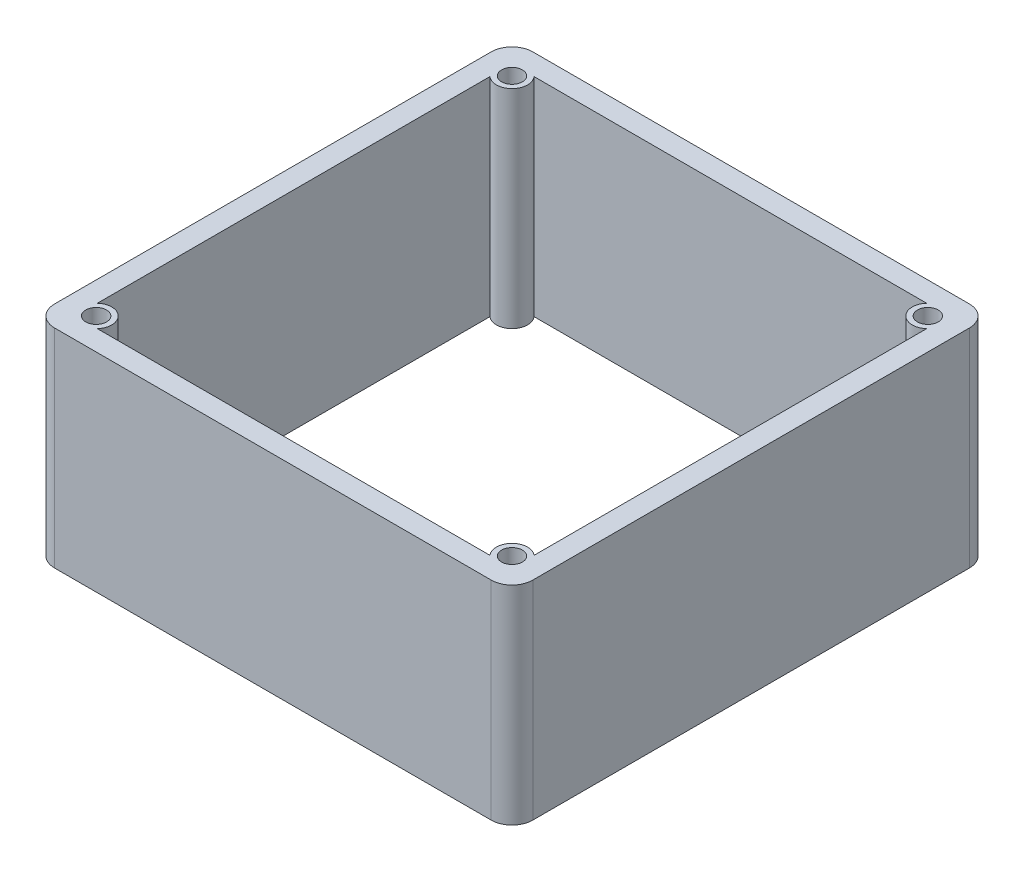
ISO-10303-21;
HEADER;
FILE_DESCRIPTION(('STEP AP214'),'2;1');
FILE_NAME('part.step','',(''),(''),'','','');
FILE_SCHEMA(('AUTOMOTIVE_DESIGN { 1 0 10303 214 1 1 1 1 }'));
ENDSEC;
DATA;
#1=APPLICATION_CONTEXT('core data for automotive mechanical design processes');
#2=APPLICATION_PROTOCOL_DEFINITION('international standard','automotive_design',2000,#1);
#3=PRODUCT_CONTEXT('',#1,'mechanical');
#4=PRODUCT('Part','Part','',(#3));
#5=PRODUCT_RELATED_PRODUCT_CATEGORY('part','',(#4));
#6=PRODUCT_DEFINITION_FORMATION('','',#4);
#7=PRODUCT_DEFINITION_CONTEXT('part definition',#1,'design');
#8=PRODUCT_DEFINITION('design','',#6,#7);
#9=PRODUCT_DEFINITION_SHAPE('','',#8);
#10=(LENGTH_UNIT() NAMED_UNIT(*) SI_UNIT(.MILLI.,.METRE.));
#11=(NAMED_UNIT(*) PLANE_ANGLE_UNIT() SI_UNIT($,.RADIAN.));
#12=(NAMED_UNIT(*) SI_UNIT($,.STERADIAN.) SOLID_ANGLE_UNIT());
#13=UNCERTAINTY_MEASURE_WITH_UNIT(LENGTH_MEASURE(1.E-05),#10,'distance_accuracy_value','');
#14=(GEOMETRIC_REPRESENTATION_CONTEXT(3) GLOBAL_UNCERTAINTY_ASSIGNED_CONTEXT((#13)) GLOBAL_UNIT_ASSIGNED_CONTEXT((#10,
#11,#12)) REPRESENTATION_CONTEXT('',''));
#15=CARTESIAN_POINT('',(0.,0.,0.));
#16=DIRECTION('',(0.,0.,1.));
#17=DIRECTION('',(1.,0.,0.));
#18=AXIS2_PLACEMENT_3D('',#15,#16,#17);
#19=CARTESIAN_POINT('',(0.,20.,0.));
#20=DIRECTION('',(0.,1.,0.));
#21=DIRECTION('',(0.,0.,1.));
#22=AXIS2_PLACEMENT_3D('',#19,#20,#21);
#23=PLANE('',#22);
#24=CARTESIAN_POINT('',(20.,20.,20.));
#25=DIRECTION('',(0.,1.,0.));
#26=DIRECTION('',(0.,0.,1.));
#27=AXIS2_PLACEMENT_3D('',#24,#25,#26);
#28=CIRCLE('',#27,1.);
#29=CARTESIAN_POINT('',(20.,20.,21.));
#30=VERTEX_POINT('',#29);
#31=EDGE_CURVE('E515',#30,#30,#28,.T.);
#32=ORIENTED_EDGE('',*,*,#31,.F.);
#33=EDGE_LOOP('',(#32));
#34=FACE_BOUND('',#33,.T.);
#35=CARTESIAN_POINT('',(-20.,20.,-20.));
#36=DIRECTION('',(0.,1.,0.));
#37=DIRECTION('',(0.,0.,1.));
#38=AXIS2_PLACEMENT_3D('',#35,#36,#37);
#39=CIRCLE('',#38,1.);
#40=CARTESIAN_POINT('',(-20.,20.,-19.));
#41=VERTEX_POINT('',#40);
#42=EDGE_CURVE('E192',#41,#41,#39,.T.);
#43=ORIENTED_EDGE('',*,*,#42,.F.);
#44=EDGE_LOOP('',(#43));
#45=FACE_BOUND('',#44,.T.);
#46=DIRECTION('',(0.,0.,1.));
#47=VECTOR('',#46,1.);
#48=CARTESIAN_POINT('',(-23.,20.,-23.));
#49=LINE('',#48,#47);
#50=CARTESIAN_POINT('',(-23.,20.,-21.));
#51=VERTEX_POINT('',#50);
#52=CARTESIAN_POINT('',(-23.,20.,21.));
#53=VERTEX_POINT('',#52);
#54=EDGE_CURVE('E228',#51,#53,#49,.T.);
#55=ORIENTED_EDGE('',*,*,#54,.T.);
#56=CARTESIAN_POINT('',(-21.,20.,21.));
#57=DIRECTION('',(0.,1.,0.));
#58=DIRECTION('',(0.,0.,1.));
#59=AXIS2_PLACEMENT_3D('',#56,#57,#58);
#60=CIRCLE('',#59,2.);
#61=CARTESIAN_POINT('',(-21.,20.,23.));
#62=VERTEX_POINT('',#61);
#63=EDGE_CURVE('E266',#53,#62,#60,.T.);
#64=ORIENTED_EDGE('',*,*,#63,.T.);
#65=DIRECTION('',(1.,0.,0.));
#66=VECTOR('',#65,1.);
#67=CARTESIAN_POINT('',(-23.,20.,23.));
#68=LINE('',#67,#66);
#69=CARTESIAN_POINT('',(21.,20.,23.));
#70=VERTEX_POINT('',#69);
#71=EDGE_CURVE('E231',#62,#70,#68,.T.);
#72=ORIENTED_EDGE('',*,*,#71,.T.);
#73=CARTESIAN_POINT('',(21.,20.,21.));
#74=DIRECTION('',(0.,1.,0.));
#75=DIRECTION('',(0.,0.,1.));
#76=AXIS2_PLACEMENT_3D('',#73,#74,#75);
#77=CIRCLE('',#76,2.);
#78=CARTESIAN_POINT('',(23.,20.,21.));
#79=VERTEX_POINT('',#78);
#80=EDGE_CURVE('E264',#70,#79,#77,.T.);
#81=ORIENTED_EDGE('',*,*,#80,.T.);
#82=DIRECTION('',(0.,0.,-1.));
#83=VECTOR('',#82,1.);
#84=CARTESIAN_POINT('',(23.,20.,-23.));
#85=LINE('',#84,#83);
#86=CARTESIAN_POINT('',(23.,20.,-21.));
#87=VERTEX_POINT('',#86);
#88=EDGE_CURVE('E223',#79,#87,#85,.T.);
#89=ORIENTED_EDGE('',*,*,#88,.T.);
#90=CARTESIAN_POINT('',(21.,20.,-21.));
#91=DIRECTION('',(0.,1.,0.));
#92=DIRECTION('',(0.,0.,1.));
#93=AXIS2_PLACEMENT_3D('',#90,#91,#92);
#94=CIRCLE('',#93,2.);
#95=CARTESIAN_POINT('',(21.,20.,-23.));
#96=VERTEX_POINT('',#95);
#97=EDGE_CURVE('E56',#87,#96,#94,.T.);
#98=ORIENTED_EDGE('',*,*,#97,.T.);
#99=DIRECTION('',(-1.,0.,0.));
#100=VECTOR('',#99,1.);
#101=CARTESIAN_POINT('',(-23.,20.,-23.));
#102=LINE('',#101,#100);
#103=CARTESIAN_POINT('',(-21.,20.,-23.));
#104=VERTEX_POINT('',#103);
#105=EDGE_CURVE('E225',#96,#104,#102,.T.);
#106=ORIENTED_EDGE('',*,*,#105,.T.);
#107=CARTESIAN_POINT('',(-21.,20.,-21.));
#108=DIRECTION('',(0.,1.,0.));
#109=DIRECTION('',(0.,0.,1.));
#110=AXIS2_PLACEMENT_3D('',#107,#108,#109);
#111=CIRCLE('',#110,2.);
#112=EDGE_CURVE('E261',#104,#51,#111,.T.);
#113=ORIENTED_EDGE('',*,*,#112,.T.);
#114=EDGE_LOOP('',(#55,#64,#72,#81,#89,#98,#106,#113));
#115=FACE_BOUND('',#114,.T.);
#116=DIRECTION('',(0.,0.,-1.));
#117=VECTOR('',#116,1.);
#118=CARTESIAN_POINT('',(21.,20.,-18.8819660112501));
#119=LINE('',#118,#117);
#120=CARTESIAN_POINT('',(21.,20.,18.8819660112501));
#121=VERTEX_POINT('',#120);
#122=CARTESIAN_POINT('',(21.,20.,-18.8819660112501));
#123=VERTEX_POINT('',#122);
#124=EDGE_CURVE('E160',#121,#123,#119,.T.);
#125=ORIENTED_EDGE('',*,*,#124,.F.);
#126=CARTESIAN_POINT('',(20.,20.,20.));
#127=DIRECTION('',(0.,-1.,0.));
#128=DIRECTION('',(0.,0.,1.));
#129=AXIS2_PLACEMENT_3D('',#126,#127,#128);
#130=CIRCLE('',#129,1.5);
#131=CARTESIAN_POINT('',(18.8819660112501,20.,21.));
#132=VERTEX_POINT('',#131);
#133=EDGE_CURVE('E150',#132,#121,#130,.T.);
#134=ORIENTED_EDGE('',*,*,#133,.F.);
#135=DIRECTION('',(1.,0.,0.));
#136=VECTOR('',#135,1.);
#137=CARTESIAN_POINT('',(-18.8819660112501,20.,21.));
#138=LINE('',#137,#136);
#139=CARTESIAN_POINT('',(-18.8819660112501,20.,21.));
#140=VERTEX_POINT('',#139);
#141=EDGE_CURVE('E188',#140,#132,#138,.T.);
#142=ORIENTED_EDGE('',*,*,#141,.F.);
#143=CARTESIAN_POINT('',(-20.,20.,20.));
#144=DIRECTION('',(0.,-1.,0.));
#145=DIRECTION('',(0.,0.,1.));
#146=AXIS2_PLACEMENT_3D('',#143,#144,#145);
#147=CIRCLE('',#146,1.5);
#148=CARTESIAN_POINT('',(-21.,20.,18.8819660112501));
#149=VERTEX_POINT('',#148);
#150=EDGE_CURVE('E185',#149,#140,#147,.T.);
#151=ORIENTED_EDGE('',*,*,#150,.F.);
#152=DIRECTION('',(0.,0.,1.));
#153=VECTOR('',#152,1.);
#154=CARTESIAN_POINT('',(-21.,20.,-18.8819660112501));
#155=LINE('',#154,#153);
#156=CARTESIAN_POINT('',(-21.,20.,-18.8819660112501));
#157=VERTEX_POINT('',#156);
#158=EDGE_CURVE('E183',#157,#149,#155,.T.);
#159=ORIENTED_EDGE('',*,*,#158,.F.);
#160=CARTESIAN_POINT('',(-20.,20.,-20.));
#161=DIRECTION('',(0.,-1.,0.));
#162=DIRECTION('',(0.,0.,1.));
#163=AXIS2_PLACEMENT_3D('',#160,#161,#162);
#164=CIRCLE('',#163,1.5);
#165=CARTESIAN_POINT('',(-18.8819660112501,20.,-21.));
#166=VERTEX_POINT('',#165);
#167=EDGE_CURVE('E181',#166,#157,#164,.T.);
#168=ORIENTED_EDGE('',*,*,#167,.F.);
#169=DIRECTION('',(-1.,0.,0.));
#170=VECTOR('',#169,1.);
#171=CARTESIAN_POINT('',(-18.8819660112501,20.,-21.));
#172=LINE('',#171,#170);
#173=CARTESIAN_POINT('',(18.8819660112501,20.,-21.));
#174=VERTEX_POINT('',#173);
#175=EDGE_CURVE('E176',#174,#166,#172,.T.);
#176=ORIENTED_EDGE('',*,*,#175,.F.);
#177=CARTESIAN_POINT('',(20.,20.,-20.));
#178=DIRECTION('',(0.,-1.,0.));
#179=DIRECTION('',(0.,0.,1.));
#180=AXIS2_PLACEMENT_3D('',#177,#178,#179);
#181=CIRCLE('',#180,1.5);
#182=EDGE_CURVE('E174',#123,#174,#181,.T.);
#183=ORIENTED_EDGE('',*,*,#182,.F.);
#184=EDGE_LOOP('',(#125,#134,#142,#151,#159,#168,#176,#183));
#185=FACE_BOUND('',#184,.T.);
#186=CARTESIAN_POINT('',(20.,20.,-20.));
#187=DIRECTION('',(0.,1.,0.));
#188=DIRECTION('',(0.,0.,1.));
#189=AXIS2_PLACEMENT_3D('',#186,#187,#188);
#190=CIRCLE('',#189,1.);
#191=CARTESIAN_POINT('',(20.,20.,-19.));
#192=VERTEX_POINT('',#191);
#193=EDGE_CURVE('E521',#192,#192,#190,.T.);
#194=ORIENTED_EDGE('',*,*,#193,.F.);
#195=EDGE_LOOP('',(#194));
#196=FACE_BOUND('',#195,.T.);
#197=CARTESIAN_POINT('',(-20.,20.,20.));
#198=DIRECTION('',(0.,1.,0.));
#199=DIRECTION('',(0.,0.,1.));
#200=AXIS2_PLACEMENT_3D('',#197,#198,#199);
#201=CIRCLE('',#200,1.);
#202=CARTESIAN_POINT('',(-20.,20.,21.));
#203=VERTEX_POINT('',#202);
#204=EDGE_CURVE('E506',#203,#203,#201,.T.);
#205=ORIENTED_EDGE('',*,*,#204,.F.);
#206=EDGE_LOOP('',(#205));
#207=FACE_BOUND('',#206,.T.);
#208=ADVANCED_FACE('F35',(#34,#45,#115,#185,#196,#207),#23,.T.);
#209=CARTESIAN_POINT('',(0.,0.,0.));
#210=DIRECTION('',(0.,1.,0.));
#211=DIRECTION('',(0.,0.,1.));
#212=AXIS2_PLACEMENT_3D('',#209,#210,#211);
#213=PLANE('',#212);
#214=DIRECTION('',(1.,0.,0.));
#215=VECTOR('',#214,1.);
#216=CARTESIAN_POINT('',(-23.,0.,23.));
#217=LINE('',#216,#215);
#218=CARTESIAN_POINT('',(-21.,0.,23.));
#219=VERTEX_POINT('',#218);
#220=CARTESIAN_POINT('',(21.,0.,23.));
#221=VERTEX_POINT('',#220);
#222=EDGE_CURVE('E226',#219,#221,#217,.T.);
#223=ORIENTED_EDGE('',*,*,#222,.F.);
#224=CARTESIAN_POINT('',(-21.,0.,21.));
#225=DIRECTION('',(0.,1.,0.));
#226=DIRECTION('',(0.,0.,1.));
#227=AXIS2_PLACEMENT_3D('',#224,#225,#226);
#228=CIRCLE('',#227,2.);
#229=CARTESIAN_POINT('',(-23.,0.,21.));
#230=VERTEX_POINT('',#229);
#231=EDGE_CURVE('E254',#219,#230,#228,.F.);
#232=ORIENTED_EDGE('',*,*,#231,.T.);
#233=DIRECTION('',(0.,0.,1.));
#234=VECTOR('',#233,1.);
#235=CARTESIAN_POINT('',(-23.,0.,-23.));
#236=LINE('',#235,#234);
#237=CARTESIAN_POINT('',(-23.,0.,-21.));
#238=VERTEX_POINT('',#237);
#239=EDGE_CURVE('E239',#238,#230,#236,.T.);
#240=ORIENTED_EDGE('',*,*,#239,.F.);
#241=CARTESIAN_POINT('',(-21.,0.,-21.));
#242=DIRECTION('',(0.,1.,0.));
#243=DIRECTION('',(0.,0.,1.));
#244=AXIS2_PLACEMENT_3D('',#241,#242,#243);
#245=CIRCLE('',#244,2.);
#246=CARTESIAN_POINT('',(-21.,0.,-23.));
#247=VERTEX_POINT('',#246);
#248=EDGE_CURVE('E248',#238,#247,#245,.F.);
#249=ORIENTED_EDGE('',*,*,#248,.T.);
#250=DIRECTION('',(-1.,0.,0.));
#251=VECTOR('',#250,1.);
#252=CARTESIAN_POINT('',(-23.,0.,-23.));
#253=LINE('',#252,#251);
#254=CARTESIAN_POINT('',(21.,0.,-23.));
#255=VERTEX_POINT('',#254);
#256=EDGE_CURVE('E237',#255,#247,#253,.T.);
#257=ORIENTED_EDGE('',*,*,#256,.F.);
#258=CARTESIAN_POINT('',(21.,0.,-21.));
#259=DIRECTION('',(0.,1.,0.));
#260=DIRECTION('',(0.,0.,1.));
#261=AXIS2_PLACEMENT_3D('',#258,#259,#260);
#262=CIRCLE('',#261,2.);
#263=CARTESIAN_POINT('',(23.,0.,-21.));
#264=VERTEX_POINT('',#263);
#265=EDGE_CURVE('E250',#255,#264,#262,.F.);
#266=ORIENTED_EDGE('',*,*,#265,.T.);
#267=DIRECTION('',(0.,0.,-1.));
#268=VECTOR('',#267,1.);
#269=CARTESIAN_POINT('',(23.,0.,-23.));
#270=LINE('',#269,#268);
#271=CARTESIAN_POINT('',(23.,0.,21.));
#272=VERTEX_POINT('',#271);
#273=EDGE_CURVE('E168',#272,#264,#270,.T.);
#274=ORIENTED_EDGE('',*,*,#273,.F.);
#275=CARTESIAN_POINT('',(21.,0.,21.));
#276=DIRECTION('',(0.,1.,0.));
#277=DIRECTION('',(0.,0.,1.));
#278=AXIS2_PLACEMENT_3D('',#275,#276,#277);
#279=CIRCLE('',#278,2.);
#280=EDGE_CURVE('E252',#272,#221,#279,.F.);
#281=ORIENTED_EDGE('',*,*,#280,.T.);
#282=EDGE_LOOP('',(#223,#232,#240,#249,#257,#266,#274,#281));
#283=FACE_BOUND('',#282,.T.);
#284=CARTESIAN_POINT('',(20.,0.,20.));
#285=DIRECTION('',(0.,-1.,0.));
#286=DIRECTION('',(0.,0.,1.));
#287=AXIS2_PLACEMENT_3D('',#284,#285,#286);
#288=CIRCLE('',#287,1.5);
#289=CARTESIAN_POINT('',(18.8819660112501,0.,21.));
#290=VERTEX_POINT('',#289);
#291=CARTESIAN_POINT('',(21.,0.,18.8819660112501));
#292=VERTEX_POINT('',#291);
#293=EDGE_CURVE('E190',#290,#292,#288,.T.);
#294=ORIENTED_EDGE('',*,*,#293,.T.);
#295=DIRECTION('',(0.,0.,-1.));
#296=VECTOR('',#295,1.);
#297=CARTESIAN_POINT('',(21.,0.,-18.8819660112501));
#298=LINE('',#297,#296);
#299=CARTESIAN_POINT('',(21.,0.,-18.8819660112501));
#300=VERTEX_POINT('',#299);
#301=EDGE_CURVE('E167',#292,#300,#298,.T.);
#302=ORIENTED_EDGE('',*,*,#301,.T.);
#303=CARTESIAN_POINT('',(20.,0.,-20.));
#304=DIRECTION('',(0.,-1.,0.));
#305=DIRECTION('',(0.,0.,1.));
#306=AXIS2_PLACEMENT_3D('',#303,#304,#305);
#307=CIRCLE('',#306,1.5);
#308=CARTESIAN_POINT('',(18.8819660112501,0.,-21.));
#309=VERTEX_POINT('',#308);
#310=EDGE_CURVE('E194',#300,#309,#307,.T.);
#311=ORIENTED_EDGE('',*,*,#310,.T.);
#312=DIRECTION('',(-1.,0.,0.));
#313=VECTOR('',#312,1.);
#314=CARTESIAN_POINT('',(-18.8819660112501,0.,-21.));
#315=LINE('',#314,#313);
#316=CARTESIAN_POINT('',(-18.8819660112501,0.,-21.));
#317=VERTEX_POINT('',#316);
#318=EDGE_CURVE('E197',#309,#317,#315,.T.);
#319=ORIENTED_EDGE('',*,*,#318,.T.);
#320=CARTESIAN_POINT('',(-20.,0.,-20.));
#321=DIRECTION('',(0.,-1.,0.));
#322=DIRECTION('',(0.,0.,1.));
#323=AXIS2_PLACEMENT_3D('',#320,#321,#322);
#324=CIRCLE('',#323,1.5);
#325=CARTESIAN_POINT('',(-21.,0.,-18.8819660112501));
#326=VERTEX_POINT('',#325);
#327=EDGE_CURVE('E200',#317,#326,#324,.T.);
#328=ORIENTED_EDGE('',*,*,#327,.T.);
#329=DIRECTION('',(0.,0.,1.));
#330=VECTOR('',#329,1.);
#331=CARTESIAN_POINT('',(-21.,0.,-18.8819660112501));
#332=LINE('',#331,#330);
#333=CARTESIAN_POINT('',(-21.,0.,18.8819660112501));
#334=VERTEX_POINT('',#333);
#335=EDGE_CURVE('E203',#326,#334,#332,.T.);
#336=ORIENTED_EDGE('',*,*,#335,.T.);
#337=CARTESIAN_POINT('',(-20.,0.,20.));
#338=DIRECTION('',(0.,-1.,0.));
#339=DIRECTION('',(0.,0.,1.));
#340=AXIS2_PLACEMENT_3D('',#337,#338,#339);
#341=CIRCLE('',#340,1.5);
#342=CARTESIAN_POINT('',(-18.8819660112501,0.,21.));
#343=VERTEX_POINT('',#342);
#344=EDGE_CURVE('E206',#334,#343,#341,.T.);
#345=ORIENTED_EDGE('',*,*,#344,.T.);
#346=DIRECTION('',(1.,0.,0.));
#347=VECTOR('',#346,1.);
#348=CARTESIAN_POINT('',(-18.8819660112501,0.,21.));
#349=LINE('',#348,#347);
#350=EDGE_CURVE('E161',#343,#290,#349,.T.);
#351=ORIENTED_EDGE('',*,*,#350,.T.);
#352=EDGE_LOOP('',(#294,#302,#311,#319,#328,#336,#345,#351));
#353=FACE_BOUND('',#352,.T.);
#354=CARTESIAN_POINT('',(-20.,0.,-20.));
#355=DIRECTION('',(0.,1.,0.));
#356=DIRECTION('',(0.,0.,1.));
#357=AXIS2_PLACEMENT_3D('',#354,#355,#356);
#358=CIRCLE('',#357,1.);
#359=CARTESIAN_POINT('',(-20.,0.,-19.));
#360=VERTEX_POINT('',#359);
#361=EDGE_CURVE('E524',#360,#360,#358,.T.);
#362=ORIENTED_EDGE('',*,*,#361,.T.);
#363=EDGE_LOOP('',(#362));
#364=FACE_BOUND('',#363,.T.);
#365=CARTESIAN_POINT('',(20.,0.,-20.));
#366=DIRECTION('',(0.,1.,0.));
#367=DIRECTION('',(0.,0.,1.));
#368=AXIS2_PLACEMENT_3D('',#365,#366,#367);
#369=CIRCLE('',#368,1.);
#370=CARTESIAN_POINT('',(20.,0.,-19.));
#371=VERTEX_POINT('',#370);
#372=EDGE_CURVE('E518',#371,#371,#369,.T.);
#373=ORIENTED_EDGE('',*,*,#372,.T.);
#374=EDGE_LOOP('',(#373));
#375=FACE_BOUND('',#374,.T.);
#376=CARTESIAN_POINT('',(20.,0.,20.));
#377=DIRECTION('',(0.,1.,0.));
#378=DIRECTION('',(0.,0.,1.));
#379=AXIS2_PLACEMENT_3D('',#376,#377,#378);
#380=CIRCLE('',#379,1.);
#381=CARTESIAN_POINT('',(20.,0.,21.));
#382=VERTEX_POINT('',#381);
#383=EDGE_CURVE('E512',#382,#382,#380,.T.);
#384=ORIENTED_EDGE('',*,*,#383,.T.);
#385=EDGE_LOOP('',(#384));
#386=FACE_BOUND('',#385,.T.);
#387=CARTESIAN_POINT('',(-20.,0.,20.));
#388=DIRECTION('',(0.,1.,0.));
#389=DIRECTION('',(0.,0.,1.));
#390=AXIS2_PLACEMENT_3D('',#387,#388,#389);
#391=CIRCLE('',#390,1.);
#392=CARTESIAN_POINT('',(-20.,0.,21.));
#393=VERTEX_POINT('',#392);
#394=EDGE_CURVE('E509',#393,#393,#391,.T.);
#395=ORIENTED_EDGE('',*,*,#394,.T.);
#396=EDGE_LOOP('',(#395));
#397=FACE_BOUND('',#396,.T.);
#398=ADVANCED_FACE('F282',(#283,#353,#364,#375,#386,#397),#213,.F.);
#399=CARTESIAN_POINT('',(23.,20.,-23.));
#400=DIRECTION('',(-1.,0.,0.));
#401=DIRECTION('',(0.,0.,1.));
#402=AXIS2_PLACEMENT_3D('',#399,#400,#401);
#403=PLANE('',#402);
#404=ORIENTED_EDGE('',*,*,#88,.F.);
#405=DIRECTION('',(0.,-1.,0.));
#406=VECTOR('',#405,1.);
#407=CARTESIAN_POINT('',(23.,20.,21.));
#408=LINE('',#407,#406);
#409=EDGE_CURVE('E270',#79,#272,#408,.T.);
#410=ORIENTED_EDGE('',*,*,#409,.T.);
#411=ORIENTED_EDGE('',*,*,#273,.T.);
#412=DIRECTION('',(0.,-1.,0.));
#413=VECTOR('',#412,1.);
#414=CARTESIAN_POINT('',(23.,20.,-21.));
#415=LINE('',#414,#413);
#416=EDGE_CURVE('E268',#264,#87,#415,.F.);
#417=ORIENTED_EDGE('',*,*,#416,.T.);
#418=EDGE_LOOP('',(#404,#410,#411,#417));
#419=FACE_BOUND('',#418,.T.);
#420=ADVANCED_FACE('F276',(#419),#403,.F.);
#421=CARTESIAN_POINT('',(-23.,20.,-23.));
#422=DIRECTION('',(0.,0.,1.));
#423=DIRECTION('',(1.,0.,0.));
#424=AXIS2_PLACEMENT_3D('',#421,#422,#423);
#425=PLANE('',#424);
#426=ORIENTED_EDGE('',*,*,#105,.F.);
#427=DIRECTION('',(0.,-1.,0.));
#428=VECTOR('',#427,1.);
#429=CARTESIAN_POINT('',(21.,20.,-23.));
#430=LINE('',#429,#428);
#431=EDGE_CURVE('E11',#96,#255,#430,.T.);
#432=ORIENTED_EDGE('',*,*,#431,.T.);
#433=ORIENTED_EDGE('',*,*,#256,.T.);
#434=DIRECTION('',(0.,-1.,0.));
#435=VECTOR('',#434,1.);
#436=CARTESIAN_POINT('',(-21.,20.,-23.));
#437=LINE('',#436,#435);
#438=EDGE_CURVE('E43',#247,#104,#437,.F.);
#439=ORIENTED_EDGE('',*,*,#438,.T.);
#440=EDGE_LOOP('',(#426,#432,#433,#439));
#441=FACE_BOUND('',#440,.T.);
#442=ADVANCED_FACE('F288',(#441),#425,.F.);
#443=CARTESIAN_POINT('',(-23.,20.,-23.));
#444=DIRECTION('',(1.,0.,0.));
#445=DIRECTION('',(0.,0.,-1.));
#446=AXIS2_PLACEMENT_3D('',#443,#444,#445);
#447=PLANE('',#446);
#448=ORIENTED_EDGE('',*,*,#239,.T.);
#449=DIRECTION('',(0.,-1.,0.));
#450=VECTOR('',#449,1.);
#451=CARTESIAN_POINT('',(-23.,20.,21.));
#452=LINE('',#451,#450);
#453=EDGE_CURVE('E259',#230,#53,#452,.F.);
#454=ORIENTED_EDGE('',*,*,#453,.T.);
#455=ORIENTED_EDGE('',*,*,#54,.F.);
#456=DIRECTION('',(0.,-1.,0.));
#457=VECTOR('',#456,1.);
#458=CARTESIAN_POINT('',(-23.,20.,-21.));
#459=LINE('',#458,#457);
#460=EDGE_CURVE('E256',#51,#238,#459,.T.);
#461=ORIENTED_EDGE('',*,*,#460,.T.);
#462=EDGE_LOOP('',(#448,#454,#455,#461));
#463=FACE_BOUND('',#462,.T.);
#464=ADVANCED_FACE('F295',(#463),#447,.F.);
#465=CARTESIAN_POINT('',(-23.,20.,23.));
#466=DIRECTION('',(0.,0.,-1.));
#467=DIRECTION('',(-1.,0.,0.));
#468=AXIS2_PLACEMENT_3D('',#465,#466,#467);
#469=PLANE('',#468);
#470=ORIENTED_EDGE('',*,*,#71,.F.);
#471=DIRECTION('',(0.,-1.,0.));
#472=VECTOR('',#471,1.);
#473=CARTESIAN_POINT('',(-21.,20.,23.));
#474=LINE('',#473,#472);
#475=EDGE_CURVE('E245',#62,#219,#474,.T.);
#476=ORIENTED_EDGE('',*,*,#475,.T.);
#477=ORIENTED_EDGE('',*,*,#222,.T.);
#478=DIRECTION('',(0.,-1.,0.));
#479=VECTOR('',#478,1.);
#480=CARTESIAN_POINT('',(21.,20.,23.));
#481=LINE('',#480,#479);
#482=EDGE_CURVE('E234',#221,#70,#481,.F.);
#483=ORIENTED_EDGE('',*,*,#482,.T.);
#484=EDGE_LOOP('',(#470,#476,#477,#483));
#485=FACE_BOUND('',#484,.T.);
#486=ADVANCED_FACE('F303',(#485),#469,.F.);
#487=CARTESIAN_POINT('',(20.,20.,20.));
#488=DIRECTION('',(0.,-1.,0.));
#489=DIRECTION('',(0.,0.,-1.));
#490=AXIS2_PLACEMENT_3D('',#487,#488,#489);
#491=CYLINDRICAL_SURFACE('',#490,1.5);
#492=ORIENTED_EDGE('',*,*,#293,.F.);
#493=DIRECTION('',(0.,-1.,0.));
#494=VECTOR('',#493,1.);
#495=CARTESIAN_POINT('',(18.8819660112501,20.,21.));
#496=LINE('',#495,#494);
#497=EDGE_CURVE('E156',#132,#290,#496,.T.);
#498=ORIENTED_EDGE('',*,*,#497,.F.);
#499=ORIENTED_EDGE('',*,*,#133,.T.);
#500=DIRECTION('',(0.,-1.,0.));
#501=VECTOR('',#500,1.);
#502=CARTESIAN_POINT('',(21.,20.,18.8819660112501));
#503=LINE('',#502,#501);
#504=EDGE_CURVE('E153',#121,#292,#503,.T.);
#505=ORIENTED_EDGE('',*,*,#504,.T.);
#506=EDGE_LOOP('',(#492,#498,#499,#505));
#507=FACE_BOUND('',#506,.T.);
#508=ADVANCED_FACE('F152',(#507),#491,.T.);
#509=CARTESIAN_POINT('',(21.,20.,-18.8819660112501));
#510=DIRECTION('',(-1.,0.,0.));
#511=DIRECTION('',(0.,0.,1.));
#512=AXIS2_PLACEMENT_3D('',#509,#510,#511);
#513=PLANE('',#512);
#514=ORIENTED_EDGE('',*,*,#301,.F.);
#515=ORIENTED_EDGE('',*,*,#504,.F.);
#516=ORIENTED_EDGE('',*,*,#124,.T.);
#517=DIRECTION('',(0.,-1.,0.));
#518=VECTOR('',#517,1.);
#519=CARTESIAN_POINT('',(21.,20.,-18.8819660112501));
#520=LINE('',#519,#518);
#521=EDGE_CURVE('E169',#123,#300,#520,.T.);
#522=ORIENTED_EDGE('',*,*,#521,.T.);
#523=EDGE_LOOP('',(#514,#515,#516,#522));
#524=FACE_BOUND('',#523,.T.);
#525=ADVANCED_FACE('F164',(#524),#513,.T.);
#526=CARTESIAN_POINT('',(20.,20.,-20.));
#527=DIRECTION('',(0.,-1.,0.));
#528=DIRECTION('',(0.,0.,-1.));
#529=AXIS2_PLACEMENT_3D('',#526,#527,#528);
#530=CYLINDRICAL_SURFACE('',#529,1.5);
#531=ORIENTED_EDGE('',*,*,#310,.F.);
#532=ORIENTED_EDGE('',*,*,#521,.F.);
#533=ORIENTED_EDGE('',*,*,#182,.T.);
#534=DIRECTION('',(0.,-1.,0.));
#535=VECTOR('',#534,1.);
#536=CARTESIAN_POINT('',(18.8819660112501,20.,-21.));
#537=LINE('',#536,#535);
#538=EDGE_CURVE('E220',#174,#309,#537,.T.);
#539=ORIENTED_EDGE('',*,*,#538,.T.);
#540=EDGE_LOOP('',(#531,#532,#533,#539));
#541=FACE_BOUND('',#540,.T.);
#542=ADVANCED_FACE('F361',(#541),#530,.T.);
#543=CARTESIAN_POINT('',(-18.8819660112501,20.,-21.));
#544=DIRECTION('',(0.,0.,1.));
#545=DIRECTION('',(1.,0.,0.));
#546=AXIS2_PLACEMENT_3D('',#543,#544,#545);
#547=PLANE('',#546);
#548=ORIENTED_EDGE('',*,*,#318,.F.);
#549=ORIENTED_EDGE('',*,*,#538,.F.);
#550=ORIENTED_EDGE('',*,*,#175,.T.);
#551=DIRECTION('',(0.,-1.,0.));
#552=VECTOR('',#551,1.);
#553=CARTESIAN_POINT('',(-18.8819660112501,20.,-21.));
#554=LINE('',#553,#552);
#555=EDGE_CURVE('E218',#166,#317,#554,.T.);
#556=ORIENTED_EDGE('',*,*,#555,.T.);
#557=EDGE_LOOP('',(#548,#549,#550,#556));
#558=FACE_BOUND('',#557,.T.);
#559=ADVANCED_FACE('F367',(#558),#547,.T.);
#560=CARTESIAN_POINT('',(-20.,20.,-20.));
#561=DIRECTION('',(0.,-1.,0.));
#562=DIRECTION('',(0.,0.,-1.));
#563=AXIS2_PLACEMENT_3D('',#560,#561,#562);
#564=CYLINDRICAL_SURFACE('',#563,1.5);
#565=ORIENTED_EDGE('',*,*,#327,.F.);
#566=ORIENTED_EDGE('',*,*,#555,.F.);
#567=ORIENTED_EDGE('',*,*,#167,.T.);
#568=DIRECTION('',(0.,-1.,0.));
#569=VECTOR('',#568,1.);
#570=CARTESIAN_POINT('',(-21.,20.,-18.8819660112501));
#571=LINE('',#570,#569);
#572=EDGE_CURVE('E216',#157,#326,#571,.T.);
#573=ORIENTED_EDGE('',*,*,#572,.T.);
#574=EDGE_LOOP('',(#565,#566,#567,#573));
#575=FACE_BOUND('',#574,.T.);
#576=ADVANCED_FACE('F375',(#575),#564,.T.);
#577=CARTESIAN_POINT('',(-21.,20.,-18.8819660112501));
#578=DIRECTION('',(1.,0.,0.));
#579=DIRECTION('',(0.,0.,-1.));
#580=AXIS2_PLACEMENT_3D('',#577,#578,#579);
#581=PLANE('',#580);
#582=ORIENTED_EDGE('',*,*,#335,.F.);
#583=ORIENTED_EDGE('',*,*,#572,.F.);
#584=ORIENTED_EDGE('',*,*,#158,.T.);
#585=DIRECTION('',(0.,-1.,0.));
#586=VECTOR('',#585,1.);
#587=CARTESIAN_POINT('',(-21.,20.,18.8819660112501));
#588=LINE('',#587,#586);
#589=EDGE_CURVE('E214',#149,#334,#588,.T.);
#590=ORIENTED_EDGE('',*,*,#589,.T.);
#591=EDGE_LOOP('',(#582,#583,#584,#590));
#592=FACE_BOUND('',#591,.T.);
#593=ADVANCED_FACE('F383',(#592),#581,.T.);
#594=CARTESIAN_POINT('',(-20.,20.,20.));
#595=DIRECTION('',(0.,-1.,0.));
#596=DIRECTION('',(0.,0.,-1.));
#597=AXIS2_PLACEMENT_3D('',#594,#595,#596);
#598=CYLINDRICAL_SURFACE('',#597,1.5);
#599=ORIENTED_EDGE('',*,*,#344,.F.);
#600=ORIENTED_EDGE('',*,*,#589,.F.);
#601=ORIENTED_EDGE('',*,*,#150,.T.);
#602=DIRECTION('',(0.,-1.,0.));
#603=VECTOR('',#602,1.);
#604=CARTESIAN_POINT('',(-18.8819660112501,20.,21.));
#605=LINE('',#604,#603);
#606=EDGE_CURVE('E212',#140,#343,#605,.T.);
#607=ORIENTED_EDGE('',*,*,#606,.T.);
#608=EDGE_LOOP('',(#599,#600,#601,#607));
#609=FACE_BOUND('',#608,.T.);
#610=ADVANCED_FACE('F391',(#609),#598,.T.);
#611=CARTESIAN_POINT('',(-18.8819660112501,20.,21.));
#612=DIRECTION('',(0.,0.,-1.));
#613=DIRECTION('',(-1.,0.,0.));
#614=AXIS2_PLACEMENT_3D('',#611,#612,#613);
#615=PLANE('',#614);
#616=ORIENTED_EDGE('',*,*,#350,.F.);
#617=ORIENTED_EDGE('',*,*,#606,.F.);
#618=ORIENTED_EDGE('',*,*,#141,.T.);
#619=ORIENTED_EDGE('',*,*,#497,.T.);
#620=EDGE_LOOP('',(#616,#617,#618,#619));
#621=FACE_BOUND('',#620,.T.);
#622=ADVANCED_FACE('F399',(#621),#615,.T.);
#623=CARTESIAN_POINT('',(-20.,20.,-20.));
#624=DIRECTION('',(0.,-1.,0.));
#625=DIRECTION('',(0.,0.,-1.));
#626=AXIS2_PLACEMENT_3D('',#623,#624,#625);
#627=CYLINDRICAL_SURFACE('',#626,1.);
#628=ORIENTED_EDGE('',*,*,#42,.T.);
#629=EDGE_LOOP('',(#628));
#630=FACE_BOUND('',#629,.T.);
#631=ORIENTED_EDGE('',*,*,#361,.F.);
#632=EDGE_LOOP('',(#631));
#633=FACE_BOUND('',#632,.T.);
#634=ADVANCED_FACE('F407',(#630,#633),#627,.F.);
#635=CARTESIAN_POINT('',(20.,20.,-20.));
#636=DIRECTION('',(0.,-1.,0.));
#637=DIRECTION('',(0.,0.,-1.));
#638=AXIS2_PLACEMENT_3D('',#635,#636,#637);
#639=CYLINDRICAL_SURFACE('',#638,1.);
#640=ORIENTED_EDGE('',*,*,#193,.T.);
#641=EDGE_LOOP('',(#640));
#642=FACE_BOUND('',#641,.T.);
#643=ORIENTED_EDGE('',*,*,#372,.F.);
#644=EDGE_LOOP('',(#643));
#645=FACE_BOUND('',#644,.T.);
#646=ADVANCED_FACE('F415',(#642,#645),#639,.F.);
#647=CARTESIAN_POINT('',(20.,20.,20.));
#648=DIRECTION('',(0.,-1.,0.));
#649=DIRECTION('',(0.,0.,-1.));
#650=AXIS2_PLACEMENT_3D('',#647,#648,#649);
#651=CYLINDRICAL_SURFACE('',#650,1.);
#652=ORIENTED_EDGE('',*,*,#31,.T.);
#653=EDGE_LOOP('',(#652));
#654=FACE_BOUND('',#653,.T.);
#655=ORIENTED_EDGE('',*,*,#383,.F.);
#656=EDGE_LOOP('',(#655));
#657=FACE_BOUND('',#656,.T.);
#658=ADVANCED_FACE('F423',(#654,#657),#651,.F.);
#659=CARTESIAN_POINT('',(-20.,20.,20.));
#660=DIRECTION('',(0.,-1.,0.));
#661=DIRECTION('',(0.,0.,-1.));
#662=AXIS2_PLACEMENT_3D('',#659,#660,#661);
#663=CYLINDRICAL_SURFACE('',#662,1.);
#664=ORIENTED_EDGE('',*,*,#204,.T.);
#665=EDGE_LOOP('',(#664));
#666=FACE_BOUND('',#665,.T.);
#667=ORIENTED_EDGE('',*,*,#394,.F.);
#668=EDGE_LOOP('',(#667));
#669=FACE_BOUND('',#668,.T.);
#670=ADVANCED_FACE('F312',(#666,#669),#663,.F.);
#671=CARTESIAN_POINT('',(-21.,20.,21.));
#672=DIRECTION('',(0.,-1.,0.));
#673=DIRECTION('',(0.,0.,-1.));
#674=AXIS2_PLACEMENT_3D('',#671,#672,#673);
#675=CYLINDRICAL_SURFACE('',#674,2.);
#676=ORIENTED_EDGE('',*,*,#63,.F.);
#677=ORIENTED_EDGE('',*,*,#453,.F.);
#678=ORIENTED_EDGE('',*,*,#231,.F.);
#679=ORIENTED_EDGE('',*,*,#475,.F.);
#680=EDGE_LOOP('',(#676,#677,#678,#679));
#681=FACE_BOUND('',#680,.T.);
#682=ADVANCED_FACE('F300',(#681),#675,.T.);
#683=CARTESIAN_POINT('',(21.,20.,21.));
#684=DIRECTION('',(0.,-1.,0.));
#685=DIRECTION('',(0.,0.,-1.));
#686=AXIS2_PLACEMENT_3D('',#683,#684,#685);
#687=CYLINDRICAL_SURFACE('',#686,2.);
#688=ORIENTED_EDGE('',*,*,#80,.F.);
#689=ORIENTED_EDGE('',*,*,#482,.F.);
#690=ORIENTED_EDGE('',*,*,#280,.F.);
#691=ORIENTED_EDGE('',*,*,#409,.F.);
#692=EDGE_LOOP('',(#688,#689,#690,#691));
#693=FACE_BOUND('',#692,.T.);
#694=ADVANCED_FACE('F305',(#693),#687,.T.);
#695=CARTESIAN_POINT('',(21.,20.,-21.));
#696=DIRECTION('',(0.,-1.,0.));
#697=DIRECTION('',(0.,0.,-1.));
#698=AXIS2_PLACEMENT_3D('',#695,#696,#697);
#699=CYLINDRICAL_SURFACE('',#698,2.);
#700=ORIENTED_EDGE('',*,*,#97,.F.);
#701=ORIENTED_EDGE('',*,*,#416,.F.);
#702=ORIENTED_EDGE('',*,*,#265,.F.);
#703=ORIENTED_EDGE('',*,*,#431,.F.);
#704=EDGE_LOOP('',(#700,#701,#702,#703));
#705=FACE_BOUND('',#704,.T.);
#706=ADVANCED_FACE('F287',(#705),#699,.T.);
#707=CARTESIAN_POINT('',(-21.,20.,-21.));
#708=DIRECTION('',(0.,-1.,0.));
#709=DIRECTION('',(0.,0.,-1.));
#710=AXIS2_PLACEMENT_3D('',#707,#708,#709);
#711=CYLINDRICAL_SURFACE('',#710,2.);
#712=ORIENTED_EDGE('',*,*,#112,.F.);
#713=ORIENTED_EDGE('',*,*,#438,.F.);
#714=ORIENTED_EDGE('',*,*,#248,.F.);
#715=ORIENTED_EDGE('',*,*,#460,.F.);
#716=EDGE_LOOP('',(#712,#713,#714,#715));
#717=FACE_BOUND('',#716,.T.);
#718=ADVANCED_FACE('F37',(#717),#711,.T.);
#719=CLOSED_SHELL('',(#208,#398,#420,#442,#464,#486,#508,#525,#542,#559,#576,#593,#610,#622,
#634,#646,#658,#670,#682,#694,#706,#718));
#720=MANIFOLD_SOLID_BREP('B2',#719);
#721=ADVANCED_BREP_SHAPE_REPRESENTATION('',(#18,#720),#14);
#722=SHAPE_DEFINITION_REPRESENTATION(#9,#721);
ENDSEC;
END-ISO-10303-21;
